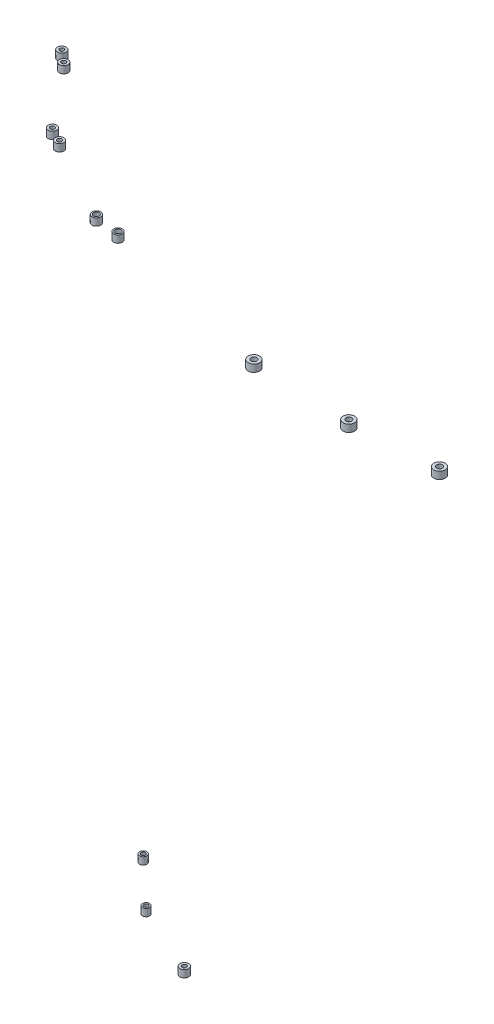
ISO-10303-21;
HEADER;
FILE_DESCRIPTION(('STEP AP214'),'2;1');
FILE_NAME('part.step','',(''),(''),'','','');
FILE_SCHEMA(('AUTOMOTIVE_DESIGN { 1 0 10303 214 1 1 1 1 }'));
ENDSEC;
DATA;
#1=APPLICATION_CONTEXT('core data for automotive mechanical design processes');
#2=APPLICATION_PROTOCOL_DEFINITION('international standard','automotive_design',2000,#1);
#3=PRODUCT_CONTEXT('',#1,'mechanical');
#4=PRODUCT('Part','Part','',(#3));
#5=PRODUCT_RELATED_PRODUCT_CATEGORY('part','',(#4));
#6=PRODUCT_DEFINITION_FORMATION('','',#4);
#7=PRODUCT_DEFINITION_CONTEXT('part definition',#1,'design');
#8=PRODUCT_DEFINITION('design','',#6,#7);
#9=PRODUCT_DEFINITION_SHAPE('','',#8);
#10=(LENGTH_UNIT() NAMED_UNIT(*) SI_UNIT(.MILLI.,.METRE.));
#11=(NAMED_UNIT(*) PLANE_ANGLE_UNIT() SI_UNIT($,.RADIAN.));
#12=(NAMED_UNIT(*) SI_UNIT($,.STERADIAN.) SOLID_ANGLE_UNIT());
#13=UNCERTAINTY_MEASURE_WITH_UNIT(LENGTH_MEASURE(1.E-05),#10,'distance_accuracy_value','');
#14=(GEOMETRIC_REPRESENTATION_CONTEXT(3) GLOBAL_UNCERTAINTY_ASSIGNED_CONTEXT((#13)) GLOBAL_UNIT_ASSIGNED_CONTEXT((#10,
#11,#12)) REPRESENTATION_CONTEXT('',''));
#15=CARTESIAN_POINT('',(0.,0.,0.));
#16=DIRECTION('',(0.,0.,1.));
#17=DIRECTION('',(1.,0.,0.));
#18=AXIS2_PLACEMENT_3D('',#15,#16,#17);
#19=CARTESIAN_POINT('',(-339.082998520851,299.7,-305.429754445409));
#20=DIRECTION('',(0.,-1.,0.));
#21=DIRECTION('',(0.,0.,1.));
#22=AXIS2_PLACEMENT_3D('',#19,#20,#21);
#23=CYLINDRICAL_SURFACE('',#22,2.50000000000002);
#24=CARTESIAN_POINT('',(-339.082998520851,299.7,-305.429754445409));
#25=DIRECTION('',(0.,1.,0.));
#26=DIRECTION('',(0.,0.,1.));
#27=AXIS2_PLACEMENT_3D('',#24,#25,#26);
#28=CIRCLE('',#27,2.50000000000002);
#29=CARTESIAN_POINT('',(-339.082998520851,299.7,-302.929754445409));
#30=VERTEX_POINT('',#29);
#31=EDGE_CURVE('E11',#30,#30,#28,.T.);
#32=ORIENTED_EDGE('',*,*,#31,.F.);
#33=EDGE_LOOP('',(#32));
#34=FACE_BOUND('',#33,.T.);
#35=CARTESIAN_POINT('',(-339.082998520851,294.7,-305.429754445409));
#36=DIRECTION('',(0.,1.,0.));
#37=DIRECTION('',(0.,0.,1.));
#38=AXIS2_PLACEMENT_3D('',#35,#36,#37);
#39=CIRCLE('',#38,2.50000000000002);
#40=CARTESIAN_POINT('',(-339.082998520851,294.7,-302.929754445409));
#41=VERTEX_POINT('',#40);
#42=EDGE_CURVE('E47',#41,#41,#39,.T.);
#43=ORIENTED_EDGE('',*,*,#42,.T.);
#44=EDGE_LOOP('',(#43));
#45=FACE_BOUND('',#44,.T.);
#46=ADVANCED_FACE('F44',(#34,#45),#23,.T.);
#47=CARTESIAN_POINT('',(-339.082998520851,299.7,-305.429754445409));
#48=DIRECTION('',(0.,-1.,0.));
#49=DIRECTION('',(0.,0.,1.));
#50=AXIS2_PLACEMENT_3D('',#47,#48,#49);
#51=PLANE('',#50);
#52=CARTESIAN_POINT('',(-339.082998520851,299.7,-305.429754445409));
#53=DIRECTION('',(0.,1.,0.));
#54=DIRECTION('',(0.,0.,1.));
#55=AXIS2_PLACEMENT_3D('',#52,#53,#54);
#56=CIRCLE('',#55,1.50000000000002);
#57=CARTESIAN_POINT('',(-339.082998520851,299.7,-303.929754445409));
#58=VERTEX_POINT('',#57);
#59=EDGE_CURVE('E54',#58,#58,#56,.T.);
#60=ORIENTED_EDGE('',*,*,#59,.F.);
#61=EDGE_LOOP('',(#60));
#62=FACE_BOUND('',#61,.T.);
#63=ORIENTED_EDGE('',*,*,#31,.T.);
#64=EDGE_LOOP('',(#63));
#65=FACE_BOUND('',#64,.T.);
#66=ADVANCED_FACE('F65',(#62,#65),#51,.F.);
#67=CARTESIAN_POINT('',(-339.082998520851,294.7,-305.429754445409));
#68=DIRECTION('',(0.,-1.,0.));
#69=DIRECTION('',(0.,0.,1.));
#70=AXIS2_PLACEMENT_3D('',#67,#68,#69);
#71=PLANE('',#70);
#72=CARTESIAN_POINT('',(-339.082998520851,294.7,-305.429754445409));
#73=DIRECTION('',(0.,1.,0.));
#74=DIRECTION('',(0.,0.,1.));
#75=AXIS2_PLACEMENT_3D('',#72,#73,#74);
#76=CIRCLE('',#75,1.50000000000002);
#77=CARTESIAN_POINT('',(-339.082998520851,294.7,-303.929754445409));
#78=VERTEX_POINT('',#77);
#79=EDGE_CURVE('E56',#78,#78,#76,.T.);
#80=ORIENTED_EDGE('',*,*,#79,.T.);
#81=EDGE_LOOP('',(#80));
#82=FACE_BOUND('',#81,.T.);
#83=ORIENTED_EDGE('',*,*,#42,.F.);
#84=EDGE_LOOP('',(#83));
#85=FACE_BOUND('',#84,.T.);
#86=ADVANCED_FACE('F67',(#82,#85),#71,.T.);
#87=CARTESIAN_POINT('',(-339.082998520851,299.7,-305.429754445409));
#88=DIRECTION('',(0.,-1.,0.));
#89=DIRECTION('',(0.,0.,1.));
#90=AXIS2_PLACEMENT_3D('',#87,#88,#89);
#91=CYLINDRICAL_SURFACE('',#90,1.50000000000002);
#92=ORIENTED_EDGE('',*,*,#59,.T.);
#93=EDGE_LOOP('',(#92));
#94=FACE_BOUND('',#93,.T.);
#95=ORIENTED_EDGE('',*,*,#79,.F.);
#96=EDGE_LOOP('',(#95));
#97=FACE_BOUND('',#96,.T.);
#98=ADVANCED_FACE('F62',(#94,#97),#91,.F.);
#99=CLOSED_SHELL('',(#46,#66,#86,#98));
#100=MANIFOLD_SOLID_BREP('B2',#99);
#101=CARTESIAN_POINT('',(-289.687055909534,299.7,-282.424125212571));
#102=DIRECTION('',(0.,-1.,0.));
#103=DIRECTION('',(0.,0.,1.));
#104=AXIS2_PLACEMENT_3D('',#101,#102,#103);
#105=CYLINDRICAL_SURFACE('',#104,2.99999999999999);
#106=CARTESIAN_POINT('',(-289.687055909534,299.7,-282.424125212571));
#107=DIRECTION('',(0.,1.,0.));
#108=DIRECTION('',(0.,0.,1.));
#109=AXIS2_PLACEMENT_3D('',#106,#107,#108);
#110=CIRCLE('',#109,2.99999999999999);
#111=CARTESIAN_POINT('',(-289.687055909534,299.7,-279.424125212571));
#112=VERTEX_POINT('',#111);
#113=EDGE_CURVE('E43',#112,#112,#110,.T.);
#114=ORIENTED_EDGE('',*,*,#113,.F.);
#115=EDGE_LOOP('',(#114));
#116=FACE_BOUND('',#115,.T.);
#117=CARTESIAN_POINT('',(-289.687055909534,294.7,-282.424125212571));
#118=DIRECTION('',(0.,1.,0.));
#119=DIRECTION('',(0.,0.,1.));
#120=AXIS2_PLACEMENT_3D('',#117,#118,#119);
#121=CIRCLE('',#120,2.99999999999999);
#122=CARTESIAN_POINT('',(-289.687055909534,294.7,-279.424125212571));
#123=VERTEX_POINT('',#122);
#124=EDGE_CURVE('E117',#123,#123,#121,.T.);
#125=ORIENTED_EDGE('',*,*,#124,.T.);
#126=EDGE_LOOP('',(#125));
#127=FACE_BOUND('',#126,.T.);
#128=ADVANCED_FACE('F114',(#116,#127),#105,.T.);
#129=CARTESIAN_POINT('',(-289.687055909534,299.7,-282.424125212571));
#130=DIRECTION('',(0.,-1.,0.));
#131=DIRECTION('',(0.,0.,1.));
#132=AXIS2_PLACEMENT_3D('',#129,#130,#131);
#133=PLANE('',#132);
#134=CARTESIAN_POINT('',(-289.687055909534,299.7,-282.424125212571));
#135=DIRECTION('',(0.,1.,0.));
#136=DIRECTION('',(0.,0.,1.));
#137=AXIS2_PLACEMENT_3D('',#134,#135,#136);
#138=CIRCLE('',#137,1.50000000000002);
#139=CARTESIAN_POINT('',(-289.687055909534,299.7,-280.924125212571));
#140=VERTEX_POINT('',#139);
#141=EDGE_CURVE('E124',#140,#140,#138,.T.);
#142=ORIENTED_EDGE('',*,*,#141,.F.);
#143=EDGE_LOOP('',(#142));
#144=FACE_BOUND('',#143,.T.);
#145=ORIENTED_EDGE('',*,*,#113,.T.);
#146=EDGE_LOOP('',(#145));
#147=FACE_BOUND('',#146,.T.);
#148=ADVANCED_FACE('F135',(#144,#147),#133,.F.);
#149=CARTESIAN_POINT('',(-289.687055909534,294.7,-282.424125212571));
#150=DIRECTION('',(0.,-1.,0.));
#151=DIRECTION('',(0.,0.,1.));
#152=AXIS2_PLACEMENT_3D('',#149,#150,#151);
#153=PLANE('',#152);
#154=CARTESIAN_POINT('',(-289.687055909534,294.7,-282.424125212571));
#155=DIRECTION('',(0.,1.,0.));
#156=DIRECTION('',(0.,0.,1.));
#157=AXIS2_PLACEMENT_3D('',#154,#155,#156);
#158=CIRCLE('',#157,1.50000000000002);
#159=CARTESIAN_POINT('',(-289.687055909534,294.7,-280.924125212571));
#160=VERTEX_POINT('',#159);
#161=EDGE_CURVE('E126',#160,#160,#158,.T.);
#162=ORIENTED_EDGE('',*,*,#161,.T.);
#163=EDGE_LOOP('',(#162));
#164=FACE_BOUND('',#163,.T.);
#165=ORIENTED_EDGE('',*,*,#124,.F.);
#166=EDGE_LOOP('',(#165));
#167=FACE_BOUND('',#166,.T.);
#168=ADVANCED_FACE('F137',(#164,#167),#153,.T.);
#169=CARTESIAN_POINT('',(-289.687055909534,299.7,-282.424125212571));
#170=DIRECTION('',(0.,-1.,0.));
#171=DIRECTION('',(0.,0.,1.));
#172=AXIS2_PLACEMENT_3D('',#169,#170,#171);
#173=CYLINDRICAL_SURFACE('',#172,1.50000000000002);
#174=ORIENTED_EDGE('',*,*,#141,.T.);
#175=EDGE_LOOP('',(#174));
#176=FACE_BOUND('',#175,.T.);
#177=ORIENTED_EDGE('',*,*,#161,.F.);
#178=EDGE_LOOP('',(#177));
#179=FACE_BOUND('',#178,.T.);
#180=ADVANCED_FACE('F132',(#176,#179),#173,.F.);
#181=CLOSED_SHELL('',(#128,#148,#168,#180));
#182=MANIFOLD_SOLID_BREP('B6',#181);
#183=CARTESIAN_POINT('',(-370.956911026411,299.7,-335.367132453118));
#184=DIRECTION('',(0.,-1.,0.));
#185=DIRECTION('',(0.,0.,1.));
#186=AXIS2_PLACEMENT_3D('',#183,#184,#185);
#187=CYLINDRICAL_SURFACE('',#186,2.50000000000002);
#188=CARTESIAN_POINT('',(-370.956911026411,299.7,-335.367132453118));
#189=DIRECTION('',(0.,1.,0.));
#190=DIRECTION('',(0.,0.,1.));
#191=AXIS2_PLACEMENT_3D('',#188,#189,#190);
#192=CIRCLE('',#191,2.50000000000002);
#193=CARTESIAN_POINT('',(-370.956911026411,299.7,-332.867132453118));
#194=VERTEX_POINT('',#193);
#195=EDGE_CURVE('E113',#194,#194,#192,.T.);
#196=ORIENTED_EDGE('',*,*,#195,.F.);
#197=EDGE_LOOP('',(#196));
#198=FACE_BOUND('',#197,.T.);
#199=CARTESIAN_POINT('',(-370.956911026411,294.7,-335.367132453118));
#200=DIRECTION('',(0.,1.,0.));
#201=DIRECTION('',(0.,0.,1.));
#202=AXIS2_PLACEMENT_3D('',#199,#200,#201);
#203=CIRCLE('',#202,2.50000000000002);
#204=CARTESIAN_POINT('',(-370.956911026411,294.7,-332.867132453118));
#205=VERTEX_POINT('',#204);
#206=EDGE_CURVE('E187',#205,#205,#203,.T.);
#207=ORIENTED_EDGE('',*,*,#206,.T.);
#208=EDGE_LOOP('',(#207));
#209=FACE_BOUND('',#208,.T.);
#210=ADVANCED_FACE('F184',(#198,#209),#187,.T.);
#211=CARTESIAN_POINT('',(-370.956911026411,299.7,-335.367132453118));
#212=DIRECTION('',(0.,-1.,0.));
#213=DIRECTION('',(0.,0.,1.));
#214=AXIS2_PLACEMENT_3D('',#211,#212,#213);
#215=PLANE('',#214);
#216=CARTESIAN_POINT('',(-370.956911026411,299.7,-335.367132453118));
#217=DIRECTION('',(0.,1.,0.));
#218=DIRECTION('',(0.,0.,1.));
#219=AXIS2_PLACEMENT_3D('',#216,#217,#218);
#220=CIRCLE('',#219,1.50000000000002);
#221=CARTESIAN_POINT('',(-370.956911026411,299.7,-333.867132453118));
#222=VERTEX_POINT('',#221);
#223=EDGE_CURVE('E194',#222,#222,#220,.T.);
#224=ORIENTED_EDGE('',*,*,#223,.F.);
#225=EDGE_LOOP('',(#224));
#226=FACE_BOUND('',#225,.T.);
#227=ORIENTED_EDGE('',*,*,#195,.T.);
#228=EDGE_LOOP('',(#227));
#229=FACE_BOUND('',#228,.T.);
#230=ADVANCED_FACE('F205',(#226,#229),#215,.F.);
#231=CARTESIAN_POINT('',(-370.956911026411,294.7,-335.367132453118));
#232=DIRECTION('',(0.,-1.,0.));
#233=DIRECTION('',(0.,0.,1.));
#234=AXIS2_PLACEMENT_3D('',#231,#232,#233);
#235=PLANE('',#234);
#236=CARTESIAN_POINT('',(-370.956911026411,294.7,-335.367132453118));
#237=DIRECTION('',(0.,1.,0.));
#238=DIRECTION('',(0.,0.,1.));
#239=AXIS2_PLACEMENT_3D('',#236,#237,#238);
#240=CIRCLE('',#239,1.50000000000002);
#241=CARTESIAN_POINT('',(-370.956911026411,294.7,-333.867132453118));
#242=VERTEX_POINT('',#241);
#243=EDGE_CURVE('E196',#242,#242,#240,.T.);
#244=ORIENTED_EDGE('',*,*,#243,.T.);
#245=EDGE_LOOP('',(#244));
#246=FACE_BOUND('',#245,.T.);
#247=ORIENTED_EDGE('',*,*,#206,.F.);
#248=EDGE_LOOP('',(#247));
#249=FACE_BOUND('',#248,.T.);
#250=ADVANCED_FACE('F207',(#246,#249),#235,.T.);
#251=CARTESIAN_POINT('',(-370.956911026411,299.7,-335.367132453118));
#252=DIRECTION('',(0.,-1.,0.));
#253=DIRECTION('',(0.,0.,1.));
#254=AXIS2_PLACEMENT_3D('',#251,#252,#253);
#255=CYLINDRICAL_SURFACE('',#254,1.50000000000002);
#256=ORIENTED_EDGE('',*,*,#223,.T.);
#257=EDGE_LOOP('',(#256));
#258=FACE_BOUND('',#257,.T.);
#259=ORIENTED_EDGE('',*,*,#243,.F.);
#260=EDGE_LOOP('',(#259));
#261=FACE_BOUND('',#260,.T.);
#262=ADVANCED_FACE('F202',(#258,#261),#255,.F.);
#263=CLOSED_SHELL('',(#210,#230,#250,#262));
#264=MANIFOLD_SOLID_BREP('B38',#263);
#265=CARTESIAN_POINT('',(-94.9095215443751,705.,-263.802212935845));
#266=DIRECTION('',(0.,1.,0.));
#267=DIRECTION('',(0.,0.,-1.));
#268=AXIS2_PLACEMENT_3D('',#265,#266,#267);
#269=PLANE('',#268);
#270=CARTESIAN_POINT('',(-94.9095215443751,705.,-263.802212935845));
#271=DIRECTION('',(0.,-1.,0.));
#272=DIRECTION('',(0.,0.,-1.));
#273=AXIS2_PLACEMENT_3D('',#270,#271,#272);
#274=CIRCLE('',#273,4.00000000000001);
#275=CARTESIAN_POINT('',(-94.9095215443751,705.,-267.802212935845));
#276=VERTEX_POINT('',#275);
#277=EDGE_CURVE('E183',#276,#276,#274,.T.);
#278=ORIENTED_EDGE('',*,*,#277,.F.);
#279=EDGE_LOOP('',(#278));
#280=FACE_BOUND('',#279,.T.);
#281=CARTESIAN_POINT('',(-94.9095215443751,705.,-263.802212935845));
#282=DIRECTION('',(0.,-1.,0.));
#283=DIRECTION('',(0.,0.,-1.));
#284=AXIS2_PLACEMENT_3D('',#281,#282,#283);
#285=CIRCLE('',#284,2.);
#286=CARTESIAN_POINT('',(-94.9095215443751,705.,-265.802212935845));
#287=VERTEX_POINT('',#286);
#288=EDGE_CURVE('E265',#287,#287,#285,.T.);
#289=ORIENTED_EDGE('',*,*,#288,.T.);
#290=EDGE_LOOP('',(#289));
#291=FACE_BOUND('',#290,.T.);
#292=ADVANCED_FACE('F254',(#280,#291),#269,.T.);
#293=CARTESIAN_POINT('',(-94.9095215443751,700.,-263.802212935845));
#294=DIRECTION('',(0.,1.,0.));
#295=DIRECTION('',(0.,0.,-1.));
#296=AXIS2_PLACEMENT_3D('',#293,#294,#295);
#297=PLANE('',#296);
#298=CARTESIAN_POINT('',(-94.9095215443751,700.,-263.802212935845));
#299=DIRECTION('',(0.,-1.,0.));
#300=DIRECTION('',(0.,0.,-1.));
#301=AXIS2_PLACEMENT_3D('',#298,#299,#300);
#302=CIRCLE('',#301,4.00000000000001);
#303=CARTESIAN_POINT('',(-94.9095215443751,700.,-267.802212935845));
#304=VERTEX_POINT('',#303);
#305=EDGE_CURVE('E258',#304,#304,#302,.T.);
#306=ORIENTED_EDGE('',*,*,#305,.T.);
#307=EDGE_LOOP('',(#306));
#308=FACE_BOUND('',#307,.T.);
#309=CARTESIAN_POINT('',(-94.9095215443751,700.,-263.802212935845));
#310=DIRECTION('',(0.,-1.,0.));
#311=DIRECTION('',(0.,0.,-1.));
#312=AXIS2_PLACEMENT_3D('',#309,#310,#311);
#313=CIRCLE('',#312,2.);
#314=CARTESIAN_POINT('',(-94.9095215443751,700.,-265.802212935845));
#315=VERTEX_POINT('',#314);
#316=EDGE_CURVE('E267',#315,#315,#313,.T.);
#317=ORIENTED_EDGE('',*,*,#316,.F.);
#318=EDGE_LOOP('',(#317));
#319=FACE_BOUND('',#318,.T.);
#320=ADVANCED_FACE('F280',(#308,#319),#297,.F.);
#321=CARTESIAN_POINT('',(-94.9095215443751,705.,-263.802212935845));
#322=DIRECTION('',(0.,-1.,0.));
#323=DIRECTION('',(0.,0.,1.));
#324=AXIS2_PLACEMENT_3D('',#321,#322,#323);
#325=CYLINDRICAL_SURFACE('',#324,4.00000000000001);
#326=ORIENTED_EDGE('',*,*,#277,.T.);
#327=EDGE_LOOP('',(#326));
#328=FACE_BOUND('',#327,.T.);
#329=ORIENTED_EDGE('',*,*,#305,.F.);
#330=EDGE_LOOP('',(#329));
#331=FACE_BOUND('',#330,.T.);
#332=ADVANCED_FACE('F256',(#328,#331),#325,.T.);
#333=CARTESIAN_POINT('',(-94.9095215443751,705.,-263.802212935845));
#334=DIRECTION('',(0.,-1.,0.));
#335=DIRECTION('',(0.,0.,1.));
#336=AXIS2_PLACEMENT_3D('',#333,#334,#335);
#337=CYLINDRICAL_SURFACE('',#336,2.);
#338=ORIENTED_EDGE('',*,*,#288,.F.);
#339=EDGE_LOOP('',(#338));
#340=FACE_BOUND('',#339,.T.);
#341=ORIENTED_EDGE('',*,*,#316,.T.);
#342=EDGE_LOOP('',(#341));
#343=FACE_BOUND('',#342,.T.);
#344=ADVANCED_FACE('F274',(#340,#343),#337,.F.);
#345=CLOSED_SHELL('',(#292,#320,#332,#344));
#346=MANIFOLD_SOLID_BREP('B108',#345);
#347=CARTESIAN_POINT('',(-154.344703344319,705.,-260.643821632466));
#348=DIRECTION('',(0.,1.,0.));
#349=DIRECTION('',(0.,0.,-1.));
#350=AXIS2_PLACEMENT_3D('',#347,#348,#349);
#351=PLANE('',#350);
#352=CARTESIAN_POINT('',(-154.344703344319,705.,-260.643821632466));
#353=DIRECTION('',(0.,-1.,0.));
#354=DIRECTION('',(0.,0.,-1.));
#355=AXIS2_PLACEMENT_3D('',#352,#353,#354);
#356=CIRCLE('',#355,3.99999999999999);
#357=CARTESIAN_POINT('',(-154.344703344319,705.,-264.643821632466));
#358=VERTEX_POINT('',#357);
#359=EDGE_CURVE('E253',#358,#358,#356,.T.);
#360=ORIENTED_EDGE('',*,*,#359,.F.);
#361=EDGE_LOOP('',(#360));
#362=FACE_BOUND('',#361,.T.);
#363=CARTESIAN_POINT('',(-154.344703344319,705.,-260.643821632466));
#364=DIRECTION('',(0.,-1.,0.));
#365=DIRECTION('',(0.,0.,-1.));
#366=AXIS2_PLACEMENT_3D('',#363,#364,#365);
#367=CIRCLE('',#366,2.);
#368=CARTESIAN_POINT('',(-154.344703344319,705.,-262.643821632466));
#369=VERTEX_POINT('',#368);
#370=EDGE_CURVE('E335',#369,#369,#367,.T.);
#371=ORIENTED_EDGE('',*,*,#370,.T.);
#372=EDGE_LOOP('',(#371));
#373=FACE_BOUND('',#372,.T.);
#374=ADVANCED_FACE('F324',(#362,#373),#351,.T.);
#375=CARTESIAN_POINT('',(-154.344703344319,700.,-260.643821632466));
#376=DIRECTION('',(0.,1.,0.));
#377=DIRECTION('',(0.,0.,-1.));
#378=AXIS2_PLACEMENT_3D('',#375,#376,#377);
#379=PLANE('',#378);
#380=CARTESIAN_POINT('',(-154.344703344319,700.,-260.643821632466));
#381=DIRECTION('',(0.,-1.,0.));
#382=DIRECTION('',(0.,0.,-1.));
#383=AXIS2_PLACEMENT_3D('',#380,#381,#382);
#384=CIRCLE('',#383,3.99999999999999);
#385=CARTESIAN_POINT('',(-154.344703344319,700.,-264.643821632466));
#386=VERTEX_POINT('',#385);
#387=EDGE_CURVE('E328',#386,#386,#384,.T.);
#388=ORIENTED_EDGE('',*,*,#387,.T.);
#389=EDGE_LOOP('',(#388));
#390=FACE_BOUND('',#389,.T.);
#391=CARTESIAN_POINT('',(-154.344703344319,700.,-260.643821632466));
#392=DIRECTION('',(0.,-1.,0.));
#393=DIRECTION('',(0.,0.,-1.));
#394=AXIS2_PLACEMENT_3D('',#391,#392,#393);
#395=CIRCLE('',#394,2.);
#396=CARTESIAN_POINT('',(-154.344703344319,700.,-262.643821632466));
#397=VERTEX_POINT('',#396);
#398=EDGE_CURVE('E337',#397,#397,#395,.T.);
#399=ORIENTED_EDGE('',*,*,#398,.F.);
#400=EDGE_LOOP('',(#399));
#401=FACE_BOUND('',#400,.T.);
#402=ADVANCED_FACE('F350',(#390,#401),#379,.F.);
#403=CARTESIAN_POINT('',(-154.344703344319,705.,-260.643821632466));
#404=DIRECTION('',(0.,-1.,0.));
#405=DIRECTION('',(0.,0.,1.));
#406=AXIS2_PLACEMENT_3D('',#403,#404,#405);
#407=CYLINDRICAL_SURFACE('',#406,3.99999999999999);
#408=ORIENTED_EDGE('',*,*,#359,.T.);
#409=EDGE_LOOP('',(#408));
#410=FACE_BOUND('',#409,.T.);
#411=ORIENTED_EDGE('',*,*,#387,.F.);
#412=EDGE_LOOP('',(#411));
#413=FACE_BOUND('',#412,.T.);
#414=ADVANCED_FACE('F326',(#410,#413),#407,.T.);
#415=CARTESIAN_POINT('',(-154.344703344319,705.,-260.643821632466));
#416=DIRECTION('',(0.,-1.,0.));
#417=DIRECTION('',(0.,0.,1.));
#418=AXIS2_PLACEMENT_3D('',#415,#416,#417);
#419=CYLINDRICAL_SURFACE('',#418,2.);
#420=ORIENTED_EDGE('',*,*,#370,.F.);
#421=EDGE_LOOP('',(#420));
#422=FACE_BOUND('',#421,.T.);
#423=ORIENTED_EDGE('',*,*,#398,.T.);
#424=EDGE_LOOP('',(#423));
#425=FACE_BOUND('',#424,.T.);
#426=ADVANCED_FACE('F344',(#422,#425),#419,.F.);
#427=CLOSED_SHELL('',(#374,#402,#414,#426));
#428=MANIFOLD_SOLID_BREP('B178',#427);
#429=CARTESIAN_POINT('',(-223.024834580686,705.,-263.802212935845));
#430=DIRECTION('',(0.,1.,0.));
#431=DIRECTION('',(0.,0.,-1.));
#432=AXIS2_PLACEMENT_3D('',#429,#430,#431);
#433=PLANE('',#432);
#434=CARTESIAN_POINT('',(-223.024834580686,705.,-263.802212935845));
#435=DIRECTION('',(0.,-1.,0.));
#436=DIRECTION('',(0.,0.,-1.));
#437=AXIS2_PLACEMENT_3D('',#434,#435,#436);
#438=CIRCLE('',#437,3.99999999999999);
#439=CARTESIAN_POINT('',(-223.024834580686,705.,-267.802212935845));
#440=VERTEX_POINT('',#439);
#441=EDGE_CURVE('E323',#440,#440,#438,.T.);
#442=ORIENTED_EDGE('',*,*,#441,.F.);
#443=EDGE_LOOP('',(#442));
#444=FACE_BOUND('',#443,.T.);
#445=CARTESIAN_POINT('',(-223.024834580686,705.,-263.802212935845));
#446=DIRECTION('',(0.,-1.,0.));
#447=DIRECTION('',(0.,0.,-1.));
#448=AXIS2_PLACEMENT_3D('',#445,#446,#447);
#449=CIRCLE('',#448,2.);
#450=CARTESIAN_POINT('',(-223.024834580686,705.,-265.802212935845));
#451=VERTEX_POINT('',#450);
#452=EDGE_CURVE('E405',#451,#451,#449,.T.);
#453=ORIENTED_EDGE('',*,*,#452,.T.);
#454=EDGE_LOOP('',(#453));
#455=FACE_BOUND('',#454,.T.);
#456=ADVANCED_FACE('F394',(#444,#455),#433,.T.);
#457=CARTESIAN_POINT('',(-223.024834580686,700.,-263.802212935845));
#458=DIRECTION('',(0.,1.,0.));
#459=DIRECTION('',(0.,0.,-1.));
#460=AXIS2_PLACEMENT_3D('',#457,#458,#459);
#461=PLANE('',#460);
#462=CARTESIAN_POINT('',(-223.024834580686,700.,-263.802212935845));
#463=DIRECTION('',(0.,-1.,0.));
#464=DIRECTION('',(0.,0.,-1.));
#465=AXIS2_PLACEMENT_3D('',#462,#463,#464);
#466=CIRCLE('',#465,3.99999999999999);
#467=CARTESIAN_POINT('',(-223.024834580686,700.,-267.802212935845));
#468=VERTEX_POINT('',#467);
#469=EDGE_CURVE('E398',#468,#468,#466,.T.);
#470=ORIENTED_EDGE('',*,*,#469,.T.);
#471=EDGE_LOOP('',(#470));
#472=FACE_BOUND('',#471,.T.);
#473=CARTESIAN_POINT('',(-223.024834580686,700.,-263.802212935845));
#474=DIRECTION('',(0.,-1.,0.));
#475=DIRECTION('',(0.,0.,-1.));
#476=AXIS2_PLACEMENT_3D('',#473,#474,#475);
#477=CIRCLE('',#476,2.);
#478=CARTESIAN_POINT('',(-223.024834580686,700.,-265.802212935845));
#479=VERTEX_POINT('',#478);
#480=EDGE_CURVE('E407',#479,#479,#477,.T.);
#481=ORIENTED_EDGE('',*,*,#480,.F.);
#482=EDGE_LOOP('',(#481));
#483=FACE_BOUND('',#482,.T.);
#484=ADVANCED_FACE('F420',(#472,#483),#461,.F.);
#485=CARTESIAN_POINT('',(-223.024834580686,705.,-263.802212935845));
#486=DIRECTION('',(0.,-1.,0.));
#487=DIRECTION('',(0.,0.,1.));
#488=AXIS2_PLACEMENT_3D('',#485,#486,#487);
#489=CYLINDRICAL_SURFACE('',#488,3.99999999999999);
#490=ORIENTED_EDGE('',*,*,#441,.T.);
#491=EDGE_LOOP('',(#490));
#492=FACE_BOUND('',#491,.T.);
#493=ORIENTED_EDGE('',*,*,#469,.F.);
#494=EDGE_LOOP('',(#493));
#495=FACE_BOUND('',#494,.T.);
#496=ADVANCED_FACE('F396',(#492,#495),#489,.T.);
#497=CARTESIAN_POINT('',(-223.024834580686,705.,-263.802212935845));
#498=DIRECTION('',(0.,-1.,0.));
#499=DIRECTION('',(0.,0.,1.));
#500=AXIS2_PLACEMENT_3D('',#497,#498,#499);
#501=CYLINDRICAL_SURFACE('',#500,2.);
#502=ORIENTED_EDGE('',*,*,#452,.F.);
#503=EDGE_LOOP('',(#502));
#504=FACE_BOUND('',#503,.T.);
#505=ORIENTED_EDGE('',*,*,#480,.T.);
#506=EDGE_LOOP('',(#505));
#507=FACE_BOUND('',#506,.T.);
#508=ADVANCED_FACE('F414',(#504,#507),#501,.F.);
#509=CLOSED_SHELL('',(#456,#484,#496,#508));
#510=MANIFOLD_SOLID_BREP('B248',#509);
#511=CARTESIAN_POINT('',(-346.389872513205,705.,-293.396246383283));
#512=DIRECTION('',(0.,1.,0.));
#513=DIRECTION('',(0.,0.,-1.));
#514=AXIS2_PLACEMENT_3D('',#511,#512,#513);
#515=PLANE('',#514);
#516=CARTESIAN_POINT('',(-346.389872513205,705.,-293.396246383283));
#517=DIRECTION('',(0.,-1.,0.));
#518=DIRECTION('',(0.,0.,-1.));
#519=AXIS2_PLACEMENT_3D('',#516,#517,#518);
#520=CIRCLE('',#519,2.99999999999999);
#521=CARTESIAN_POINT('',(-346.389872513205,705.,-296.396246383283));
#522=VERTEX_POINT('',#521);
#523=EDGE_CURVE('E393',#522,#522,#520,.T.);
#524=ORIENTED_EDGE('',*,*,#523,.F.);
#525=EDGE_LOOP('',(#524));
#526=FACE_BOUND('',#525,.T.);
#527=CARTESIAN_POINT('',(-346.389872513205,705.,-293.396246383283));
#528=DIRECTION('',(0.,-1.,0.));
#529=DIRECTION('',(0.,0.,-1.));
#530=AXIS2_PLACEMENT_3D('',#527,#528,#529);
#531=CIRCLE('',#530,2.);
#532=CARTESIAN_POINT('',(-346.389872513205,705.,-295.396246383283));
#533=VERTEX_POINT('',#532);
#534=EDGE_CURVE('E475',#533,#533,#531,.T.);
#535=ORIENTED_EDGE('',*,*,#534,.T.);
#536=EDGE_LOOP('',(#535));
#537=FACE_BOUND('',#536,.T.);
#538=ADVANCED_FACE('F464',(#526,#537),#515,.T.);
#539=CARTESIAN_POINT('',(-346.389872513205,700.,-293.396246383283));
#540=DIRECTION('',(0.,1.,0.));
#541=DIRECTION('',(0.,0.,-1.));
#542=AXIS2_PLACEMENT_3D('',#539,#540,#541);
#543=PLANE('',#542);
#544=CARTESIAN_POINT('',(-346.389872513205,700.,-293.396246383283));
#545=DIRECTION('',(0.,-1.,0.));
#546=DIRECTION('',(0.,0.,-1.));
#547=AXIS2_PLACEMENT_3D('',#544,#545,#546);
#548=CIRCLE('',#547,2.99999999999999);
#549=CARTESIAN_POINT('',(-346.389872513205,700.,-296.396246383283));
#550=VERTEX_POINT('',#549);
#551=EDGE_CURVE('E468',#550,#550,#548,.T.);
#552=ORIENTED_EDGE('',*,*,#551,.T.);
#553=EDGE_LOOP('',(#552));
#554=FACE_BOUND('',#553,.T.);
#555=CARTESIAN_POINT('',(-346.389872513205,700.,-293.396246383283));
#556=DIRECTION('',(0.,-1.,0.));
#557=DIRECTION('',(0.,0.,-1.));
#558=AXIS2_PLACEMENT_3D('',#555,#556,#557);
#559=CIRCLE('',#558,2.);
#560=CARTESIAN_POINT('',(-346.389872513205,700.,-295.396246383283));
#561=VERTEX_POINT('',#560);
#562=EDGE_CURVE('E477',#561,#561,#559,.T.);
#563=ORIENTED_EDGE('',*,*,#562,.F.);
#564=EDGE_LOOP('',(#563));
#565=FACE_BOUND('',#564,.T.);
#566=ADVANCED_FACE('F490',(#554,#565),#543,.F.);
#567=CARTESIAN_POINT('',(-346.389872513205,705.,-293.396246383283));
#568=DIRECTION('',(0.,-1.,0.));
#569=DIRECTION('',(0.,0.,1.));
#570=AXIS2_PLACEMENT_3D('',#567,#568,#569);
#571=CYLINDRICAL_SURFACE('',#570,2.99999999999999);
#572=ORIENTED_EDGE('',*,*,#523,.T.);
#573=EDGE_LOOP('',(#572));
#574=FACE_BOUND('',#573,.T.);
#575=ORIENTED_EDGE('',*,*,#551,.F.);
#576=EDGE_LOOP('',(#575));
#577=FACE_BOUND('',#576,.T.);
#578=ADVANCED_FACE('F466',(#574,#577),#571,.T.);
#579=CARTESIAN_POINT('',(-346.389872513205,705.,-293.396246383283));
#580=DIRECTION('',(0.,-1.,0.));
#581=DIRECTION('',(0.,0.,1.));
#582=AXIS2_PLACEMENT_3D('',#579,#580,#581);
#583=CYLINDRICAL_SURFACE('',#582,2.);
#584=ORIENTED_EDGE('',*,*,#534,.F.);
#585=EDGE_LOOP('',(#584));
#586=FACE_BOUND('',#585,.T.);
#587=ORIENTED_EDGE('',*,*,#562,.T.);
#588=EDGE_LOOP('',(#587));
#589=FACE_BOUND('',#588,.T.);
#590=ADVANCED_FACE('F484',(#586,#589),#583,.F.);
#591=CLOSED_SHELL('',(#538,#566,#578,#590));
#592=MANIFOLD_SOLID_BREP('B318',#591);
#593=CARTESIAN_POINT('',(-364.051137420954,705.,-296.101801858513));
#594=DIRECTION('',(0.,1.,0.));
#595=DIRECTION('',(0.,0.,-1.));
#596=AXIS2_PLACEMENT_3D('',#593,#594,#595);
#597=PLANE('',#596);
#598=CARTESIAN_POINT('',(-364.051137420954,705.,-296.101801858513));
#599=DIRECTION('',(0.,-1.,0.));
#600=DIRECTION('',(0.,0.,-1.));
#601=AXIS2_PLACEMENT_3D('',#598,#599,#600);
#602=CIRCLE('',#601,2.99999999999999);
#603=CARTESIAN_POINT('',(-364.051137420954,705.,-299.101801858513));
#604=VERTEX_POINT('',#603);
#605=EDGE_CURVE('E463',#604,#604,#602,.T.);
#606=ORIENTED_EDGE('',*,*,#605,.F.);
#607=EDGE_LOOP('',(#606));
#608=FACE_BOUND('',#607,.T.);
#609=CARTESIAN_POINT('',(-364.051137420954,705.,-296.101801858513));
#610=DIRECTION('',(0.,-1.,0.));
#611=DIRECTION('',(0.,0.,-1.));
#612=AXIS2_PLACEMENT_3D('',#609,#610,#611);
#613=CIRCLE('',#612,2.);
#614=CARTESIAN_POINT('',(-364.051137420954,705.,-298.101801858513));
#615=VERTEX_POINT('',#614);
#616=EDGE_CURVE('E545',#615,#615,#613,.T.);
#617=ORIENTED_EDGE('',*,*,#616,.T.);
#618=EDGE_LOOP('',(#617));
#619=FACE_BOUND('',#618,.T.);
#620=ADVANCED_FACE('F534',(#608,#619),#597,.T.);
#621=CARTESIAN_POINT('',(-364.051137420954,700.,-296.101801858513));
#622=DIRECTION('',(0.,1.,0.));
#623=DIRECTION('',(0.,0.,-1.));
#624=AXIS2_PLACEMENT_3D('',#621,#622,#623);
#625=PLANE('',#624);
#626=CARTESIAN_POINT('',(-364.051137420954,700.,-296.101801858513));
#627=DIRECTION('',(0.,-1.,0.));
#628=DIRECTION('',(0.,0.,-1.));
#629=AXIS2_PLACEMENT_3D('',#626,#627,#628);
#630=CIRCLE('',#629,2.99999999999999);
#631=CARTESIAN_POINT('',(-364.051137420954,700.,-299.101801858513));
#632=VERTEX_POINT('',#631);
#633=EDGE_CURVE('E538',#632,#632,#630,.T.);
#634=ORIENTED_EDGE('',*,*,#633,.T.);
#635=EDGE_LOOP('',(#634));
#636=FACE_BOUND('',#635,.T.);
#637=CARTESIAN_POINT('',(-364.051137420954,700.,-296.101801858513));
#638=DIRECTION('',(0.,-1.,0.));
#639=DIRECTION('',(0.,0.,-1.));
#640=AXIS2_PLACEMENT_3D('',#637,#638,#639);
#641=CIRCLE('',#640,2.);
#642=CARTESIAN_POINT('',(-364.051137420954,700.,-298.101801858513));
#643=VERTEX_POINT('',#642);
#644=EDGE_CURVE('E547',#643,#643,#641,.T.);
#645=ORIENTED_EDGE('',*,*,#644,.F.);
#646=EDGE_LOOP('',(#645));
#647=FACE_BOUND('',#646,.T.);
#648=ADVANCED_FACE('F560',(#636,#647),#625,.F.);
#649=CARTESIAN_POINT('',(-364.051137420954,705.,-296.101801858513));
#650=DIRECTION('',(0.,-1.,0.));
#651=DIRECTION('',(0.,0.,1.));
#652=AXIS2_PLACEMENT_3D('',#649,#650,#651);
#653=CYLINDRICAL_SURFACE('',#652,2.99999999999999);
#654=ORIENTED_EDGE('',*,*,#605,.T.);
#655=EDGE_LOOP('',(#654));
#656=FACE_BOUND('',#655,.T.);
#657=ORIENTED_EDGE('',*,*,#633,.F.);
#658=EDGE_LOOP('',(#657));
#659=FACE_BOUND('',#658,.T.);
#660=ADVANCED_FACE('F536',(#656,#659),#653,.T.);
#661=CARTESIAN_POINT('',(-364.051137420954,705.,-296.101801858513));
#662=DIRECTION('',(0.,-1.,0.));
#663=DIRECTION('',(0.,0.,1.));
#664=AXIS2_PLACEMENT_3D('',#661,#662,#663);
#665=CYLINDRICAL_SURFACE('',#664,2.);
#666=ORIENTED_EDGE('',*,*,#616,.F.);
#667=EDGE_LOOP('',(#666));
#668=FACE_BOUND('',#667,.T.);
#669=ORIENTED_EDGE('',*,*,#644,.T.);
#670=EDGE_LOOP('',(#669));
#671=FACE_BOUND('',#670,.T.);
#672=ADVANCED_FACE('F554',(#668,#671),#665,.F.);
#673=CLOSED_SHELL('',(#620,#648,#660,#672));
#674=MANIFOLD_SOLID_BREP('B388',#673);
#675=CARTESIAN_POINT('',(-421.090050281492,705.,-327.725114351705));
#676=DIRECTION('',(0.,1.,0.));
#677=DIRECTION('',(0.,0.,-1.));
#678=AXIS2_PLACEMENT_3D('',#675,#676,#677);
#679=PLANE('',#678);
#680=CARTESIAN_POINT('',(-421.090050281492,705.,-327.725114351705));
#681=DIRECTION('',(0.,-1.,0.));
#682=DIRECTION('',(0.,0.,-1.));
#683=AXIS2_PLACEMENT_3D('',#680,#681,#682);
#684=CIRCLE('',#683,2.99999999999999);
#685=CARTESIAN_POINT('',(-421.090050281492,705.,-330.725114351705));
#686=VERTEX_POINT('',#685);
#687=EDGE_CURVE('E533',#686,#686,#684,.T.);
#688=ORIENTED_EDGE('',*,*,#687,.F.);
#689=EDGE_LOOP('',(#688));
#690=FACE_BOUND('',#689,.T.);
#691=CARTESIAN_POINT('',(-421.090050281492,705.,-327.725114351705));
#692=DIRECTION('',(0.,-1.,0.));
#693=DIRECTION('',(0.,0.,-1.));
#694=AXIS2_PLACEMENT_3D('',#691,#692,#693);
#695=CIRCLE('',#694,1.50000000000002);
#696=CARTESIAN_POINT('',(-421.090050281492,705.,-329.225114351705));
#697=VERTEX_POINT('',#696);
#698=EDGE_CURVE('E615',#697,#697,#695,.T.);
#699=ORIENTED_EDGE('',*,*,#698,.T.);
#700=EDGE_LOOP('',(#699));
#701=FACE_BOUND('',#700,.T.);
#702=ADVANCED_FACE('F604',(#690,#701),#679,.T.);
#703=CARTESIAN_POINT('',(-421.090050281492,700.,-327.725114351705));
#704=DIRECTION('',(0.,1.,0.));
#705=DIRECTION('',(0.,0.,-1.));
#706=AXIS2_PLACEMENT_3D('',#703,#704,#705);
#707=PLANE('',#706);
#708=CARTESIAN_POINT('',(-421.090050281492,700.,-327.725114351705));
#709=DIRECTION('',(0.,-1.,0.));
#710=DIRECTION('',(0.,0.,-1.));
#711=AXIS2_PLACEMENT_3D('',#708,#709,#710);
#712=CIRCLE('',#711,2.99999999999999);
#713=CARTESIAN_POINT('',(-421.090050281492,700.,-330.725114351705));
#714=VERTEX_POINT('',#713);
#715=EDGE_CURVE('E608',#714,#714,#712,.T.);
#716=ORIENTED_EDGE('',*,*,#715,.T.);
#717=EDGE_LOOP('',(#716));
#718=FACE_BOUND('',#717,.T.);
#719=CARTESIAN_POINT('',(-421.090050281492,700.,-327.725114351705));
#720=DIRECTION('',(0.,-1.,0.));
#721=DIRECTION('',(0.,0.,-1.));
#722=AXIS2_PLACEMENT_3D('',#719,#720,#721);
#723=CIRCLE('',#722,1.50000000000002);
#724=CARTESIAN_POINT('',(-421.090050281492,700.,-329.225114351705));
#725=VERTEX_POINT('',#724);
#726=EDGE_CURVE('E617',#725,#725,#723,.T.);
#727=ORIENTED_EDGE('',*,*,#726,.F.);
#728=EDGE_LOOP('',(#727));
#729=FACE_BOUND('',#728,.T.);
#730=ADVANCED_FACE('F630',(#718,#729),#707,.F.);
#731=CARTESIAN_POINT('',(-421.090050281492,705.,-327.725114351705));
#732=DIRECTION('',(0.,-1.,0.));
#733=DIRECTION('',(0.,0.,1.));
#734=AXIS2_PLACEMENT_3D('',#731,#732,#733);
#735=CYLINDRICAL_SURFACE('',#734,2.99999999999999);
#736=ORIENTED_EDGE('',*,*,#687,.T.);
#737=EDGE_LOOP('',(#736));
#738=FACE_BOUND('',#737,.T.);
#739=ORIENTED_EDGE('',*,*,#715,.F.);
#740=EDGE_LOOP('',(#739));
#741=FACE_BOUND('',#740,.T.);
#742=ADVANCED_FACE('F606',(#738,#741),#735,.T.);
#743=CARTESIAN_POINT('',(-421.090050281492,705.,-327.725114351705));
#744=DIRECTION('',(0.,-1.,0.));
#745=DIRECTION('',(0.,0.,1.));
#746=AXIS2_PLACEMENT_3D('',#743,#744,#745);
#747=CYLINDRICAL_SURFACE('',#746,1.50000000000002);
#748=ORIENTED_EDGE('',*,*,#698,.F.);
#749=EDGE_LOOP('',(#748));
#750=FACE_BOUND('',#749,.T.);
#751=ORIENTED_EDGE('',*,*,#726,.T.);
#752=EDGE_LOOP('',(#751));
#753=FACE_BOUND('',#752,.T.);
#754=ADVANCED_FACE('F624',(#750,#753),#747,.F.);
#755=CLOSED_SHELL('',(#702,#730,#742,#754));
#756=MANIFOLD_SOLID_BREP('B458',#755);
#757=CARTESIAN_POINT('',(-431.039698401952,705.,-332.774189517311));
#758=DIRECTION('',(0.,1.,0.));
#759=DIRECTION('',(0.,0.,-1.));
#760=AXIS2_PLACEMENT_3D('',#757,#758,#759);
#761=PLANE('',#760);
#762=CARTESIAN_POINT('',(-431.039698401952,705.,-332.774189517311));
#763=DIRECTION('',(0.,-1.,0.));
#764=DIRECTION('',(0.,0.,-1.));
#765=AXIS2_PLACEMENT_3D('',#762,#763,#764);
#766=CIRCLE('',#765,2.99999999999999);
#767=CARTESIAN_POINT('',(-431.039698401952,705.,-335.774189517311));
#768=VERTEX_POINT('',#767);
#769=EDGE_CURVE('E603',#768,#768,#766,.T.);
#770=ORIENTED_EDGE('',*,*,#769,.F.);
#771=EDGE_LOOP('',(#770));
#772=FACE_BOUND('',#771,.T.);
#773=CARTESIAN_POINT('',(-431.039698401952,705.,-332.774189517311));
#774=DIRECTION('',(0.,-1.,0.));
#775=DIRECTION('',(0.,0.,-1.));
#776=AXIS2_PLACEMENT_3D('',#773,#774,#775);
#777=CIRCLE('',#776,1.50000000000002);
#778=CARTESIAN_POINT('',(-431.039698401952,705.,-334.274189517311));
#779=VERTEX_POINT('',#778);
#780=EDGE_CURVE('E685',#779,#779,#777,.T.);
#781=ORIENTED_EDGE('',*,*,#780,.T.);
#782=EDGE_LOOP('',(#781));
#783=FACE_BOUND('',#782,.T.);
#784=ADVANCED_FACE('F674',(#772,#783),#761,.T.);
#785=CARTESIAN_POINT('',(-431.039698401952,700.,-332.774189517311));
#786=DIRECTION('',(0.,1.,0.));
#787=DIRECTION('',(0.,0.,-1.));
#788=AXIS2_PLACEMENT_3D('',#785,#786,#787);
#789=PLANE('',#788);
#790=CARTESIAN_POINT('',(-431.039698401952,700.,-332.774189517311));
#791=DIRECTION('',(0.,-1.,0.));
#792=DIRECTION('',(0.,0.,-1.));
#793=AXIS2_PLACEMENT_3D('',#790,#791,#792);
#794=CIRCLE('',#793,2.99999999999999);
#795=CARTESIAN_POINT('',(-431.039698401952,700.,-335.774189517311));
#796=VERTEX_POINT('',#795);
#797=EDGE_CURVE('E678',#796,#796,#794,.T.);
#798=ORIENTED_EDGE('',*,*,#797,.T.);
#799=EDGE_LOOP('',(#798));
#800=FACE_BOUND('',#799,.T.);
#801=CARTESIAN_POINT('',(-431.039698401952,700.,-332.774189517311));
#802=DIRECTION('',(0.,-1.,0.));
#803=DIRECTION('',(0.,0.,-1.));
#804=AXIS2_PLACEMENT_3D('',#801,#802,#803);
#805=CIRCLE('',#804,1.50000000000002);
#806=CARTESIAN_POINT('',(-431.039698401952,700.,-334.274189517311));
#807=VERTEX_POINT('',#806);
#808=EDGE_CURVE('E687',#807,#807,#805,.T.);
#809=ORIENTED_EDGE('',*,*,#808,.F.);
#810=EDGE_LOOP('',(#809));
#811=FACE_BOUND('',#810,.T.);
#812=ADVANCED_FACE('F700',(#800,#811),#789,.F.);
#813=CARTESIAN_POINT('',(-431.039698401952,705.,-332.774189517311));
#814=DIRECTION('',(0.,-1.,0.));
#815=DIRECTION('',(0.,0.,1.));
#816=AXIS2_PLACEMENT_3D('',#813,#814,#815);
#817=CYLINDRICAL_SURFACE('',#816,2.99999999999999);
#818=ORIENTED_EDGE('',*,*,#769,.T.);
#819=EDGE_LOOP('',(#818));
#820=FACE_BOUND('',#819,.T.);
#821=ORIENTED_EDGE('',*,*,#797,.F.);
#822=EDGE_LOOP('',(#821));
#823=FACE_BOUND('',#822,.T.);
#824=ADVANCED_FACE('F676',(#820,#823),#817,.T.);
#825=CARTESIAN_POINT('',(-431.039698401952,705.,-332.774189517311));
#826=DIRECTION('',(0.,-1.,0.));
#827=DIRECTION('',(0.,0.,1.));
#828=AXIS2_PLACEMENT_3D('',#825,#826,#827);
#829=CYLINDRICAL_SURFACE('',#828,1.50000000000002);
#830=ORIENTED_EDGE('',*,*,#780,.F.);
#831=EDGE_LOOP('',(#830));
#832=FACE_BOUND('',#831,.T.);
#833=ORIENTED_EDGE('',*,*,#808,.T.);
#834=EDGE_LOOP('',(#833));
#835=FACE_BOUND('',#834,.T.);
#836=ADVANCED_FACE('F694',(#832,#835),#829,.F.);
#837=CLOSED_SHELL('',(#784,#812,#824,#836));
#838=MANIFOLD_SOLID_BREP('B528',#837);
#839=CARTESIAN_POINT('',(-466.308050673724,705.,-375.859415010098));
#840=DIRECTION('',(0.,1.,0.));
#841=DIRECTION('',(0.,0.,-1.));
#842=AXIS2_PLACEMENT_3D('',#839,#840,#841);
#843=PLANE('',#842);
#844=CARTESIAN_POINT('',(-466.308050673724,705.,-375.859415010098));
#845=DIRECTION('',(0.,-1.,0.));
#846=DIRECTION('',(0.,0.,-1.));
#847=AXIS2_PLACEMENT_3D('',#844,#845,#846);
#848=CIRCLE('',#847,2.99999999999999);
#849=CARTESIAN_POINT('',(-466.308050673724,705.,-378.859415010098));
#850=VERTEX_POINT('',#849);
#851=EDGE_CURVE('E673',#850,#850,#848,.T.);
#852=ORIENTED_EDGE('',*,*,#851,.F.);
#853=EDGE_LOOP('',(#852));
#854=FACE_BOUND('',#853,.T.);
#855=CARTESIAN_POINT('',(-466.308050673724,705.,-375.859415010098));
#856=DIRECTION('',(0.,-1.,0.));
#857=DIRECTION('',(0.,0.,-1.));
#858=AXIS2_PLACEMENT_3D('',#855,#856,#857);
#859=CIRCLE('',#858,1.50000000000002);
#860=CARTESIAN_POINT('',(-466.308050673724,705.,-377.359415010098));
#861=VERTEX_POINT('',#860);
#862=EDGE_CURVE('E754',#861,#861,#859,.T.);
#863=ORIENTED_EDGE('',*,*,#862,.T.);
#864=EDGE_LOOP('',(#863));
#865=FACE_BOUND('',#864,.T.);
#866=ADVANCED_FACE('F743',(#854,#865),#843,.T.);
#867=CARTESIAN_POINT('',(-466.308050673724,700.,-375.859415010098));
#868=DIRECTION('',(0.,1.,0.));
#869=DIRECTION('',(0.,0.,-1.));
#870=AXIS2_PLACEMENT_3D('',#867,#868,#869);
#871=PLANE('',#870);
#872=CARTESIAN_POINT('',(-466.308050673724,700.,-375.859415010098));
#873=DIRECTION('',(0.,-1.,0.));
#874=DIRECTION('',(0.,0.,-1.));
#875=AXIS2_PLACEMENT_3D('',#872,#873,#874);
#876=CIRCLE('',#875,2.99999999999999);
#877=CARTESIAN_POINT('',(-466.308050673724,700.,-378.859415010098));
#878=VERTEX_POINT('',#877);
#879=EDGE_CURVE('E747',#878,#878,#876,.T.);
#880=ORIENTED_EDGE('',*,*,#879,.T.);
#881=EDGE_LOOP('',(#880));
#882=FACE_BOUND('',#881,.T.);
#883=CARTESIAN_POINT('',(-466.308050673724,700.,-375.859415010098));
#884=DIRECTION('',(0.,-1.,0.));
#885=DIRECTION('',(0.,0.,-1.));
#886=AXIS2_PLACEMENT_3D('',#883,#884,#885);
#887=CIRCLE('',#886,1.50000000000002);
#888=CARTESIAN_POINT('',(-466.308050673724,700.,-377.359415010098));
#889=VERTEX_POINT('',#888);
#890=EDGE_CURVE('E756',#889,#889,#887,.T.);
#891=ORIENTED_EDGE('',*,*,#890,.F.);
#892=EDGE_LOOP('',(#891));
#893=FACE_BOUND('',#892,.T.);
#894=ADVANCED_FACE('F769',(#882,#893),#871,.F.);
#895=CARTESIAN_POINT('',(-466.308050673724,705.,-375.859415010098));
#896=DIRECTION('',(0.,-1.,0.));
#897=DIRECTION('',(0.,0.,1.));
#898=AXIS2_PLACEMENT_3D('',#895,#896,#897);
#899=CYLINDRICAL_SURFACE('',#898,2.99999999999999);
#900=ORIENTED_EDGE('',*,*,#851,.T.);
#901=EDGE_LOOP('',(#900));
#902=FACE_BOUND('',#901,.T.);
#903=ORIENTED_EDGE('',*,*,#879,.F.);
#904=EDGE_LOOP('',(#903));
#905=FACE_BOUND('',#904,.T.);
#906=ADVANCED_FACE('F745',(#902,#905),#899,.T.);
#907=CARTESIAN_POINT('',(-466.308050673724,705.,-375.859415010098));
#908=DIRECTION('',(0.,-1.,0.));
#909=DIRECTION('',(0.,0.,1.));
#910=AXIS2_PLACEMENT_3D('',#907,#908,#909);
#911=CYLINDRICAL_SURFACE('',#910,1.50000000000002);
#912=ORIENTED_EDGE('',*,*,#862,.F.);
#913=EDGE_LOOP('',(#912));
#914=FACE_BOUND('',#913,.T.);
#915=ORIENTED_EDGE('',*,*,#890,.T.);
#916=EDGE_LOOP('',(#915));
#917=FACE_BOUND('',#916,.T.);
#918=ADVANCED_FACE('F763',(#914,#917),#911,.F.);
#919=CLOSED_SHELL('',(#866,#894,#906,#918));
#920=MANIFOLD_SOLID_BREP('B598',#919);
#921=CARTESIAN_POINT('',(-474.446759549431,705.,-382.687799990321));
#922=DIRECTION('',(0.,1.,0.));
#923=DIRECTION('',(0.,0.,-1.));
#924=AXIS2_PLACEMENT_3D('',#921,#922,#923);
#925=PLANE('',#924);
#926=CARTESIAN_POINT('',(-474.446759549431,705.,-382.687799990321));
#927=DIRECTION('',(0.,-1.,0.));
#928=DIRECTION('',(0.,0.,-1.));
#929=AXIS2_PLACEMENT_3D('',#926,#927,#928);
#930=CIRCLE('',#929,2.99999999999999);
#931=CARTESIAN_POINT('',(-474.446759549431,705.,-385.687799990321));
#932=VERTEX_POINT('',#931);
#933=EDGE_CURVE('E742',#932,#932,#930,.T.);
#934=ORIENTED_EDGE('',*,*,#933,.F.);
#935=EDGE_LOOP('',(#934));
#936=FACE_BOUND('',#935,.T.);
#937=CARTESIAN_POINT('',(-474.446759549431,705.,-382.687799990321));
#938=DIRECTION('',(0.,-1.,0.));
#939=DIRECTION('',(0.,0.,-1.));
#940=AXIS2_PLACEMENT_3D('',#937,#938,#939);
#941=CIRCLE('',#940,1.50000000000002);
#942=CARTESIAN_POINT('',(-474.446759549431,705.,-384.187799990321));
#943=VERTEX_POINT('',#942);
#944=EDGE_CURVE('E816',#943,#943,#941,.T.);
#945=ORIENTED_EDGE('',*,*,#944,.T.);
#946=EDGE_LOOP('',(#945));
#947=FACE_BOUND('',#946,.T.);
#948=ADVANCED_FACE('F805',(#936,#947),#925,.T.);
#949=CARTESIAN_POINT('',(-474.446759549431,700.,-382.687799990321));
#950=DIRECTION('',(0.,1.,0.));
#951=DIRECTION('',(0.,0.,-1.));
#952=AXIS2_PLACEMENT_3D('',#949,#950,#951);
#953=PLANE('',#952);
#954=CARTESIAN_POINT('',(-474.446759549431,700.,-382.687799990321));
#955=DIRECTION('',(0.,-1.,0.));
#956=DIRECTION('',(0.,0.,-1.));
#957=AXIS2_PLACEMENT_3D('',#954,#955,#956);
#958=CIRCLE('',#957,2.99999999999999);
#959=CARTESIAN_POINT('',(-474.446759549431,700.,-385.687799990321));
#960=VERTEX_POINT('',#959);
#961=EDGE_CURVE('E809',#960,#960,#958,.T.);
#962=ORIENTED_EDGE('',*,*,#961,.T.);
#963=EDGE_LOOP('',(#962));
#964=FACE_BOUND('',#963,.T.);
#965=CARTESIAN_POINT('',(-474.446759549431,700.,-382.687799990321));
#966=DIRECTION('',(0.,-1.,0.));
#967=DIRECTION('',(0.,0.,-1.));
#968=AXIS2_PLACEMENT_3D('',#965,#966,#967);
#969=CIRCLE('',#968,1.50000000000002);
#970=CARTESIAN_POINT('',(-474.446759549431,700.,-384.187799990321));
#971=VERTEX_POINT('',#970);
#972=EDGE_CURVE('E818',#971,#971,#969,.T.);
#973=ORIENTED_EDGE('',*,*,#972,.F.);
#974=EDGE_LOOP('',(#973));
#975=FACE_BOUND('',#974,.T.);
#976=ADVANCED_FACE('F831',(#964,#975),#953,.F.);
#977=CARTESIAN_POINT('',(-474.446759549431,705.,-382.687799990321));
#978=DIRECTION('',(0.,-1.,0.));
#979=DIRECTION('',(0.,0.,1.));
#980=AXIS2_PLACEMENT_3D('',#977,#978,#979);
#981=CYLINDRICAL_SURFACE('',#980,2.99999999999999);
#982=ORIENTED_EDGE('',*,*,#933,.T.);
#983=EDGE_LOOP('',(#982));
#984=FACE_BOUND('',#983,.T.);
#985=ORIENTED_EDGE('',*,*,#961,.F.);
#986=EDGE_LOOP('',(#985));
#987=FACE_BOUND('',#986,.T.);
#988=ADVANCED_FACE('F807',(#984,#987),#981,.T.);
#989=CARTESIAN_POINT('',(-474.446759549431,705.,-382.687799990321));
#990=DIRECTION('',(0.,-1.,0.));
#991=DIRECTION('',(0.,0.,1.));
#992=AXIS2_PLACEMENT_3D('',#989,#990,#991);
#993=CYLINDRICAL_SURFACE('',#992,1.50000000000002);
#994=ORIENTED_EDGE('',*,*,#944,.F.);
#995=EDGE_LOOP('',(#994));
#996=FACE_BOUND('',#995,.T.);
#997=ORIENTED_EDGE('',*,*,#972,.T.);
#998=EDGE_LOOP('',(#997));
#999=FACE_BOUND('',#998,.T.);
#1000=ADVANCED_FACE('F825',(#996,#999),#993,.F.);
#1001=CLOSED_SHELL('',(#948,#976,#988,#1000));
#1002=MANIFOLD_SOLID_BREP('B668',#1001);
#1003=ADVANCED_BREP_SHAPE_REPRESENTATION('',(#18,#100,#182,#264,#346,#428,#510,#592,#674,#756,
#838,#920,#1002),#14);
#1004=SHAPE_DEFINITION_REPRESENTATION(#9,#1003);
ENDSEC;
END-ISO-10303-21;
